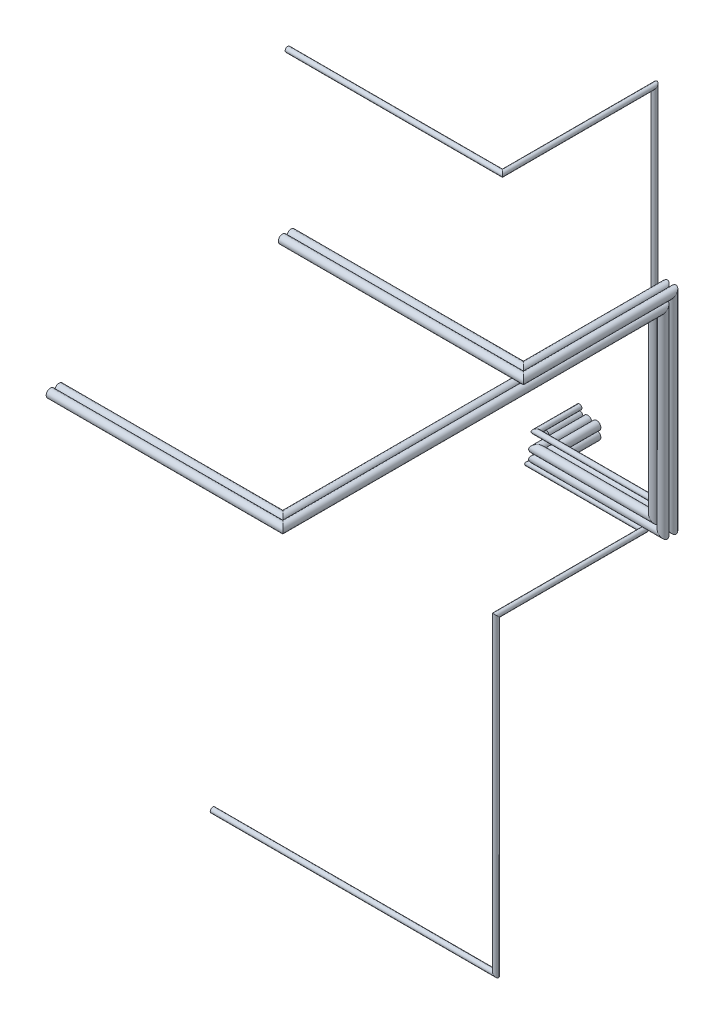
ISO-10303-21;
HEADER;
FILE_DESCRIPTION(('STEP AP214'),'2;1');
FILE_NAME('part.step','',(''),(''),'','','');
FILE_SCHEMA(('AUTOMOTIVE_DESIGN { 1 0 10303 214 1 1 1 1 }'));
ENDSEC;
DATA;
#1=APPLICATION_CONTEXT('core data for automotive mechanical design processes');
#2=APPLICATION_PROTOCOL_DEFINITION('international standard','automotive_design',2000,#1);
#3=PRODUCT_CONTEXT('',#1,'mechanical');
#4=PRODUCT('Part','Part','',(#3));
#5=PRODUCT_RELATED_PRODUCT_CATEGORY('part','',(#4));
#6=PRODUCT_DEFINITION_FORMATION('','',#4);
#7=PRODUCT_DEFINITION_CONTEXT('part definition',#1,'design');
#8=PRODUCT_DEFINITION('design','',#6,#7);
#9=PRODUCT_DEFINITION_SHAPE('','',#8);
#10=(LENGTH_UNIT() NAMED_UNIT(*) SI_UNIT(.MILLI.,.METRE.));
#11=(NAMED_UNIT(*) PLANE_ANGLE_UNIT() SI_UNIT($,.RADIAN.));
#12=(NAMED_UNIT(*) SI_UNIT($,.STERADIAN.) SOLID_ANGLE_UNIT());
#13=UNCERTAINTY_MEASURE_WITH_UNIT(LENGTH_MEASURE(1.E-05),#10,'distance_accuracy_value','');
#14=(GEOMETRIC_REPRESENTATION_CONTEXT(3) GLOBAL_UNCERTAINTY_ASSIGNED_CONTEXT((#13)) GLOBAL_UNIT_ASSIGNED_CONTEXT((#10,
#11,#12)) REPRESENTATION_CONTEXT('',''));
#15=CARTESIAN_POINT('',(0.,0.,0.));
#16=DIRECTION('',(0.,0.,1.));
#17=DIRECTION('',(1.,0.,0.));
#18=AXIS2_PLACEMENT_3D('',#15,#16,#17);
#19=CARTESIAN_POINT('',(1300.70779004029,4438.11213748302,2310.99077274705));
#20=DIRECTION('',(-1.,0.,0.));
#21=DIRECTION('',(0.,0.,1.));
#22=AXIS2_PLACEMENT_3D('',#19,#20,#21);
#23=CYLINDRICAL_SURFACE('',#22,30.);
#24=CARTESIAN_POINT('',(1300.70779004029,4438.11213748302,2310.99077274705));
#25=DIRECTION('',(-0.707106781186547,0.,0.707106781186548));
#26=DIRECTION('',(0.707106781186548,0.,0.707106781186547));
#27=AXIS2_PLACEMENT_3D('',#24,#25,#26);
#28=ELLIPSE('',#27,42.4264068711929,30.);
#29=CARTESIAN_POINT('',(1330.70779004029,4438.11213748302,2340.99077274705));
#30=VERTEX_POINT('',#29);
#31=EDGE_CURVE('E72',#30,#30,#28,.T.);
#32=ORIENTED_EDGE('',*,*,#31,.T.);
#33=EDGE_LOOP('',(#32));
#34=FACE_BOUND('',#33,.T.);
#35=CARTESIAN_POINT('',(-1240.42607973365,4438.11213748302,2310.99077274705));
#36=DIRECTION('',(-1.,0.,0.));
#37=DIRECTION('',(0.,0.,1.));
#38=AXIS2_PLACEMENT_3D('',#35,#36,#37);
#39=CIRCLE('',#38,30.);
#40=CARTESIAN_POINT('',(-1240.42607973365,4438.11213748302,2340.99077274705));
#41=VERTEX_POINT('',#40);
#42=EDGE_CURVE('E12',#41,#41,#39,.F.);
#43=ORIENTED_EDGE('',*,*,#42,.T.);
#44=EDGE_LOOP('',(#43));
#45=FACE_BOUND('',#44,.T.);
#46=ADVANCED_FACE('F66',(#34,#45),#23,.T.);
#47=CARTESIAN_POINT('',(1300.70779004029,4438.11213748302,510.99077274705));
#48=DIRECTION('',(0.,0.,1.));
#49=DIRECTION('',(1.,0.,0.));
#50=AXIS2_PLACEMENT_3D('',#47,#48,#49);
#51=CYLINDRICAL_SURFACE('',#50,30.);
#52=CARTESIAN_POINT('',(1300.70779004029,4438.11213748302,510.99077274705));
#53=DIRECTION('',(0.,0.707106781186548,0.707106781186548));
#54=DIRECTION('',(0.,0.707106781186548,-0.707106781186548));
#55=AXIS2_PLACEMENT_3D('',#52,#53,#54);
#56=ELLIPSE('',#55,42.4264068711928,30.);
#57=CARTESIAN_POINT('',(1300.70779004029,4468.11213748302,480.99077274705));
#58=VERTEX_POINT('',#57);
#59=EDGE_CURVE('E76',#58,#58,#56,.F.);
#60=ORIENTED_EDGE('',*,*,#59,.F.);
#61=EDGE_LOOP('',(#60));
#62=FACE_BOUND('',#61,.T.);
#63=ORIENTED_EDGE('',*,*,#31,.F.);
#64=EDGE_LOOP('',(#63));
#65=FACE_BOUND('',#64,.T.);
#66=ADVANCED_FACE('F110',(#62,#65),#51,.T.);
#67=CARTESIAN_POINT('',(1300.70779004029,188.112137483015,510.99077274705));
#68=DIRECTION('',(0.,1.,0.));
#69=DIRECTION('',(-1.,0.,0.));
#70=AXIS2_PLACEMENT_3D('',#67,#68,#69);
#71=CYLINDRICAL_SURFACE('',#70,30.);
#72=CARTESIAN_POINT('',(1300.70779004029,188.112137483015,510.99077274705));
#73=DIRECTION('',(0.707106781186547,0.707106781186548,0.));
#74=DIRECTION('',(0.707106781186548,-0.707106781186547,0.));
#75=AXIS2_PLACEMENT_3D('',#72,#73,#74);
#76=ELLIPSE('',#75,42.4264068711928,30.);
#77=CARTESIAN_POINT('',(1330.70779004029,158.112137483015,510.99077274705));
#78=VERTEX_POINT('',#77);
#79=EDGE_CURVE('E80',#78,#78,#76,.T.);
#80=ORIENTED_EDGE('',*,*,#79,.T.);
#81=EDGE_LOOP('',(#80));
#82=FACE_BOUND('',#81,.T.);
#83=ORIENTED_EDGE('',*,*,#59,.T.);
#84=EDGE_LOOP('',(#83));
#85=FACE_BOUND('',#84,.T.);
#86=ADVANCED_FACE('F104',(#82,#85),#71,.T.);
#87=CARTESIAN_POINT('',(-99.2922099597104,188.112137483015,510.99077274705));
#88=DIRECTION('',(1.,0.,0.));
#89=DIRECTION('',(0.,0.,-1.));
#90=AXIS2_PLACEMENT_3D('',#87,#88,#89);
#91=CYLINDRICAL_SURFACE('',#90,30.);
#92=CARTESIAN_POINT('',(-99.2922099597104,188.112137483015,510.99077274705));
#93=DIRECTION('',(0.707106781186548,0.,0.707106781186548));
#94=DIRECTION('',(0.707106781186548,0.,-0.707106781186548));
#95=AXIS2_PLACEMENT_3D('',#92,#93,#94);
#96=ELLIPSE('',#95,42.4264068711928,30.);
#97=CARTESIAN_POINT('',(-69.2922099597104,188.112137483015,480.99077274705));
#98=VERTEX_POINT('',#97);
#99=EDGE_CURVE('E85',#98,#98,#96,.F.);
#100=ORIENTED_EDGE('',*,*,#99,.F.);
#101=EDGE_LOOP('',(#100));
#102=FACE_BOUND('',#101,.T.);
#103=ORIENTED_EDGE('',*,*,#79,.F.);
#104=EDGE_LOOP('',(#103));
#105=FACE_BOUND('',#104,.T.);
#106=ADVANCED_FACE('F101',(#102,#105),#91,.T.);
#107=CARTESIAN_POINT('',(-99.2922099597104,188.112137483015,0.));
#108=DIRECTION('',(0.,0.,-1.));
#109=DIRECTION('',(-1.,0.,0.));
#110=AXIS2_PLACEMENT_3D('',#107,#108,#109);
#111=PLANE('',#110);
#112=CARTESIAN_POINT('',(-99.2922099597104,188.112137483015,0.));
#113=DIRECTION('',(0.,0.,-1.));
#114=DIRECTION('',(-1.,0.,0.));
#115=AXIS2_PLACEMENT_3D('',#112,#113,#114);
#116=CIRCLE('',#115,30.);
#117=CARTESIAN_POINT('',(-129.29220995971,188.112137483015,0.));
#118=VERTEX_POINT('',#117);
#119=EDGE_CURVE('E88',#118,#118,#116,.T.);
#120=ORIENTED_EDGE('',*,*,#119,.T.);
#121=EDGE_LOOP('',(#120));
#122=FACE_BOUND('',#121,.T.);
#123=ADVANCED_FACE('F92',(#122),#111,.T.);
#124=CARTESIAN_POINT('',(-99.2922099597104,188.112137483015,595.843586489435));
#125=DIRECTION('',(0.,0.,-1.));
#126=DIRECTION('',(-1.,0.,0.));
#127=AXIS2_PLACEMENT_3D('',#124,#125,#126);
#128=CYLINDRICAL_SURFACE('',#127,30.);
#129=ORIENTED_EDGE('',*,*,#119,.F.);
#130=EDGE_LOOP('',(#129));
#131=FACE_BOUND('',#130,.T.);
#132=ORIENTED_EDGE('',*,*,#99,.T.);
#133=EDGE_LOOP('',(#132));
#134=FACE_BOUND('',#133,.T.);
#135=ADVANCED_FACE('F94',(#131,#134),#128,.T.);
#136=CARTESIAN_POINT('',(-1240.42607973365,4438.11213748302,2310.99077274705));
#137=DIRECTION('',(-1.,0.,0.));
#138=DIRECTION('',(0.,0.,1.));
#139=AXIS2_PLACEMENT_3D('',#136,#137,#138);
#140=PLANE('',#139);
#141=ORIENTED_EDGE('',*,*,#42,.F.);
#142=EDGE_LOOP('',(#141));
#143=FACE_BOUND('',#142,.T.);
#144=ADVANCED_FACE('F97',(#143),#140,.T.);
#145=CLOSED_SHELL('',(#46,#66,#86,#106,#123,#135,#144));
#146=MANIFOLD_SOLID_BREP('B2',#145);
#147=CARTESIAN_POINT('',(1250.70779004029,-3775.40455596034,2337.65326941673));
#148=DIRECTION('',(-1.,0.,0.));
#149=DIRECTION('',(0.,0.,1.));
#150=AXIS2_PLACEMENT_3D('',#147,#148,#149);
#151=CYLINDRICAL_SURFACE('',#150,30.);
#152=CARTESIAN_POINT('',(1250.70779004029,-3775.40455596034,2337.65326941673));
#153=DIRECTION('',(-0.707106781186547,-0.707106781186548,0.));
#154=DIRECTION('',(0.707106781186548,-0.707106781186547,0.));
#155=AXIS2_PLACEMENT_3D('',#152,#153,#154);
#156=ELLIPSE('',#155,42.4264068711929,30.);
#157=CARTESIAN_POINT('',(1280.70779004029,-3805.40455596034,2337.65326941673));
#158=VERTEX_POINT('',#157);
#159=EDGE_CURVE('E181',#158,#158,#156,.T.);
#160=ORIENTED_EDGE('',*,*,#159,.T.);
#161=EDGE_LOOP('',(#160));
#162=FACE_BOUND('',#161,.T.);
#163=CARTESIAN_POINT('',(-2100.96796055242,-3775.40455596034,2337.65326941673));
#164=DIRECTION('',(-1.,0.,0.));
#165=DIRECTION('',(0.,0.,1.));
#166=AXIS2_PLACEMENT_3D('',#163,#164,#165);
#167=CIRCLE('',#166,30.);
#168=CARTESIAN_POINT('',(-2100.96796055242,-3775.40455596034,2367.65326941673));
#169=VERTEX_POINT('',#168);
#170=EDGE_CURVE('E65',#169,#169,#167,.F.);
#171=ORIENTED_EDGE('',*,*,#170,.T.);
#172=EDGE_LOOP('',(#171));
#173=FACE_BOUND('',#172,.T.);
#174=ADVANCED_FACE('F175',(#162,#173),#151,.T.);
#175=CARTESIAN_POINT('',(1250.70779004029,-103.996357315317,2337.65326941673));
#176=DIRECTION('',(0.,-1.,0.));
#177=DIRECTION('',(0.,0.,-1.));
#178=AXIS2_PLACEMENT_3D('',#175,#176,#177);
#179=CYLINDRICAL_SURFACE('',#178,30.);
#180=CARTESIAN_POINT('',(1250.70779004029,-103.996357315317,2337.65326941673));
#181=DIRECTION('',(0.,-0.707106781186548,0.707106781186547));
#182=DIRECTION('',(0.,0.707106781186547,0.707106781186548));
#183=AXIS2_PLACEMENT_3D('',#180,#181,#182);
#184=ELLIPSE('',#183,42.4264068711929,30.);
#185=CARTESIAN_POINT('',(1250.70779004029,-73.9963573153173,2367.65326941673));
#186=VERTEX_POINT('',#185);
#187=EDGE_CURVE('E185',#186,#186,#184,.F.);
#188=ORIENTED_EDGE('',*,*,#187,.F.);
#189=EDGE_LOOP('',(#188));
#190=FACE_BOUND('',#189,.T.);
#191=ORIENTED_EDGE('',*,*,#159,.F.);
#192=EDGE_LOOP('',(#191));
#193=FACE_BOUND('',#192,.T.);
#194=ADVANCED_FACE('F219',(#190,#193),#179,.T.);
#195=CARTESIAN_POINT('',(1250.70779004029,-103.996357315317,587.653269416733));
#196=DIRECTION('',(0.,0.,1.));
#197=DIRECTION('',(1.,0.,0.));
#198=AXIS2_PLACEMENT_3D('',#195,#196,#197);
#199=CYLINDRICAL_SURFACE('',#198,30.);
#200=CARTESIAN_POINT('',(1250.70779004029,-103.996357315317,587.653269416733));
#201=DIRECTION('',(0.707106781186548,0.,0.707106781186548));
#202=DIRECTION('',(0.707106781186548,0.,-0.707106781186548));
#203=AXIS2_PLACEMENT_3D('',#200,#201,#202);
#204=ELLIPSE('',#203,42.4264068711928,30.);
#205=CARTESIAN_POINT('',(1280.70779004029,-103.996357315317,557.653269416733));
#206=VERTEX_POINT('',#205);
#207=EDGE_CURVE('E189',#206,#206,#204,.T.);
#208=ORIENTED_EDGE('',*,*,#207,.T.);
#209=EDGE_LOOP('',(#208));
#210=FACE_BOUND('',#209,.T.);
#211=ORIENTED_EDGE('',*,*,#187,.T.);
#212=EDGE_LOOP('',(#211));
#213=FACE_BOUND('',#212,.T.);
#214=ADVANCED_FACE('F213',(#210,#213),#199,.T.);
#215=CARTESIAN_POINT('',(-99.2922099597104,-103.996357315317,587.653269416734));
#216=DIRECTION('',(1.,0.,0.));
#217=DIRECTION('',(0.,0.,-1.));
#218=AXIS2_PLACEMENT_3D('',#215,#216,#217);
#219=CYLINDRICAL_SURFACE('',#218,30.);
#220=CARTESIAN_POINT('',(-99.2922099597104,-103.996357315317,587.653269416734));
#221=DIRECTION('',(0.707106781186548,0.,0.707106781186547));
#222=DIRECTION('',(0.707106781186547,0.,-0.707106781186548));
#223=AXIS2_PLACEMENT_3D('',#220,#221,#222);
#224=ELLIPSE('',#223,42.4264068711928,30.);
#225=CARTESIAN_POINT('',(-69.2922099597104,-103.996357315317,557.653269416734));
#226=VERTEX_POINT('',#225);
#227=EDGE_CURVE('E194',#226,#226,#224,.F.);
#228=ORIENTED_EDGE('',*,*,#227,.F.);
#229=EDGE_LOOP('',(#228));
#230=FACE_BOUND('',#229,.T.);
#231=ORIENTED_EDGE('',*,*,#207,.F.);
#232=EDGE_LOOP('',(#231));
#233=FACE_BOUND('',#232,.T.);
#234=ADVANCED_FACE('F210',(#230,#233),#219,.T.);
#235=CARTESIAN_POINT('',(-99.2922099597104,-103.996357315317,0.));
#236=DIRECTION('',(0.,0.,-1.));
#237=DIRECTION('',(-1.,0.,0.));
#238=AXIS2_PLACEMENT_3D('',#235,#236,#237);
#239=PLANE('',#238);
#240=CARTESIAN_POINT('',(-99.2922099597104,-103.996357315317,0.));
#241=DIRECTION('',(0.,0.,-1.));
#242=DIRECTION('',(-1.,0.,0.));
#243=AXIS2_PLACEMENT_3D('',#240,#241,#242);
#244=CIRCLE('',#243,30.);
#245=CARTESIAN_POINT('',(-129.29220995971,-103.996357315317,0.));
#246=VERTEX_POINT('',#245);
#247=EDGE_CURVE('E197',#246,#246,#244,.T.);
#248=ORIENTED_EDGE('',*,*,#247,.T.);
#249=EDGE_LOOP('',(#248));
#250=FACE_BOUND('',#249,.T.);
#251=ADVANCED_FACE('F201',(#250),#239,.T.);
#252=CARTESIAN_POINT('',(-99.2922099597104,-103.996357315317,672.506083159119));
#253=DIRECTION('',(0.,0.,-1.));
#254=DIRECTION('',(-1.,0.,0.));
#255=AXIS2_PLACEMENT_3D('',#252,#253,#254);
#256=CYLINDRICAL_SURFACE('',#255,30.);
#257=ORIENTED_EDGE('',*,*,#247,.F.);
#258=EDGE_LOOP('',(#257));
#259=FACE_BOUND('',#258,.T.);
#260=ORIENTED_EDGE('',*,*,#227,.T.);
#261=EDGE_LOOP('',(#260));
#262=FACE_BOUND('',#261,.T.);
#263=ADVANCED_FACE('F203',(#259,#262),#256,.T.);
#264=CARTESIAN_POINT('',(-2100.96796055242,-3775.40455596034,2337.65326941673));
#265=DIRECTION('',(-1.,0.,0.));
#266=DIRECTION('',(0.,0.,1.));
#267=AXIS2_PLACEMENT_3D('',#264,#265,#266);
#268=PLANE('',#267);
#269=ORIENTED_EDGE('',*,*,#170,.F.);
#270=EDGE_LOOP('',(#269));
#271=FACE_BOUND('',#270,.T.);
#272=ADVANCED_FACE('F206',(#271),#268,.T.);
#273=CLOSED_SHELL('',(#174,#194,#214,#234,#251,#263,#272));
#274=MANIFOLD_SOLID_BREP('B7',#273);
#275=CARTESIAN_POINT('',(-104.92939809415,105.,400.));
#276=DIRECTION('',(0.,0.,-1.));
#277=DIRECTION('',(-1.,0.,0.));
#278=AXIS2_PLACEMENT_3D('',#275,#276,#277);
#279=CYLINDRICAL_SURFACE('',#278,50.);
#280=CARTESIAN_POINT('',(-104.92939809415,105.,400.));
#281=DIRECTION('',(0.,0.,-1.));
#282=DIRECTION('',(-1.,0.,0.));
#283=AXIS2_PLACEMENT_3D('',#280,#281,#282);
#284=CIRCLE('',#283,50.);
#285=CARTESIAN_POINT('',(-154.92939809415,105.,400.));
#286=VERTEX_POINT('',#285);
#287=EDGE_CURVE('E174',#286,#286,#284,.T.);
#288=ORIENTED_EDGE('',*,*,#287,.T.);
#289=EDGE_LOOP('',(#288));
#290=FACE_BOUND('',#289,.T.);
#291=CARTESIAN_POINT('',(-104.92939809415,105.,0.));
#292=DIRECTION('',(0.,0.,-1.));
#293=DIRECTION('',(-1.,0.,0.));
#294=AXIS2_PLACEMENT_3D('',#291,#292,#293);
#295=CIRCLE('',#294,50.);
#296=CARTESIAN_POINT('',(-154.92939809415,105.,0.));
#297=VERTEX_POINT('',#296);
#298=EDGE_CURVE('E287',#297,#297,#295,.T.);
#299=ORIENTED_EDGE('',*,*,#298,.F.);
#300=EDGE_LOOP('',(#299));
#301=FACE_BOUND('',#300,.T.);
#302=ADVANCED_FACE('F284',(#290,#301),#279,.T.);
#303=CARTESIAN_POINT('',(-104.92939809415,105.,400.));
#304=DIRECTION('',(0.,0.,-1.));
#305=DIRECTION('',(-1.,0.,0.));
#306=AXIS2_PLACEMENT_3D('',#303,#304,#305);
#307=PLANE('',#306);
#308=ORIENTED_EDGE('',*,*,#287,.F.);
#309=EDGE_LOOP('',(#308));
#310=FACE_BOUND('',#309,.T.);
#311=ADVANCED_FACE('F299',(#310),#307,.F.);
#312=CARTESIAN_POINT('',(-104.92939809415,105.,0.));
#313=DIRECTION('',(0.,0.,-1.));
#314=DIRECTION('',(-1.,0.,0.));
#315=AXIS2_PLACEMENT_3D('',#312,#313,#314);
#316=PLANE('',#315);
#317=ORIENTED_EDGE('',*,*,#298,.T.);
#318=EDGE_LOOP('',(#317));
#319=FACE_BOUND('',#318,.T.);
#320=ADVANCED_FACE('F296',(#319),#316,.T.);
#321=CLOSED_SHELL('',(#302,#311,#320));
#322=MANIFOLD_SOLID_BREP('B60',#321);
#323=CARTESIAN_POINT('',(-104.92939809415,0.,400.));
#324=DIRECTION('',(0.,0.,-1.));
#325=DIRECTION('',(-1.,0.,0.));
#326=AXIS2_PLACEMENT_3D('',#323,#324,#325);
#327=CYLINDRICAL_SURFACE('',#326,50.);
#328=CARTESIAN_POINT('',(-104.92939809415,0.,400.));
#329=DIRECTION('',(0.,0.,-1.));
#330=DIRECTION('',(-1.,0.,0.));
#331=AXIS2_PLACEMENT_3D('',#328,#329,#330);
#332=CIRCLE('',#331,50.);
#333=CARTESIAN_POINT('',(-154.92939809415,0.,400.));
#334=VERTEX_POINT('',#333);
#335=EDGE_CURVE('E283',#334,#334,#332,.T.);
#336=ORIENTED_EDGE('',*,*,#335,.T.);
#337=EDGE_LOOP('',(#336));
#338=FACE_BOUND('',#337,.T.);
#339=CARTESIAN_POINT('',(-104.92939809415,0.,0.));
#340=DIRECTION('',(0.,0.,-1.));
#341=DIRECTION('',(-1.,0.,0.));
#342=AXIS2_PLACEMENT_3D('',#339,#340,#341);
#343=CIRCLE('',#342,50.);
#344=CARTESIAN_POINT('',(-154.92939809415,0.,0.));
#345=VERTEX_POINT('',#344);
#346=EDGE_CURVE('E336',#345,#345,#343,.T.);
#347=ORIENTED_EDGE('',*,*,#346,.F.);
#348=EDGE_LOOP('',(#347));
#349=FACE_BOUND('',#348,.T.);
#350=ADVANCED_FACE('F333',(#338,#349),#327,.T.);
#351=CARTESIAN_POINT('',(-104.92939809415,0.,400.));
#352=DIRECTION('',(0.,0.,-1.));
#353=DIRECTION('',(-1.,0.,0.));
#354=AXIS2_PLACEMENT_3D('',#351,#352,#353);
#355=PLANE('',#354);
#356=ORIENTED_EDGE('',*,*,#335,.F.);
#357=EDGE_LOOP('',(#356));
#358=FACE_BOUND('',#357,.T.);
#359=ADVANCED_FACE('F348',(#358),#355,.F.);
#360=CARTESIAN_POINT('',(-104.92939809415,0.,0.));
#361=DIRECTION('',(0.,0.,-1.));
#362=DIRECTION('',(-1.,0.,0.));
#363=AXIS2_PLACEMENT_3D('',#360,#361,#362);
#364=PLANE('',#363);
#365=ORIENTED_EDGE('',*,*,#346,.T.);
#366=EDGE_LOOP('',(#365));
#367=FACE_BOUND('',#366,.T.);
#368=ADVANCED_FACE('F345',(#367),#364,.T.);
#369=CLOSED_SHELL('',(#350,#359,#368));
#370=MANIFOLD_SOLID_BREP('B169',#369);
#371=CARTESIAN_POINT('',(1388.36768599158,2300.,600.));
#372=DIRECTION('',(0.,0.,1.));
#373=DIRECTION('',(1.,0.,0.));
#374=AXIS2_PLACEMENT_3D('',#371,#372,#373);
#375=CYLINDRICAL_SURFACE('',#374,50.);
#376=CARTESIAN_POINT('',(1388.36768599158,2300.,600.));
#377=DIRECTION('',(0.,0.707106781186548,0.707106781186547));
#378=DIRECTION('',(0.,0.707106781186547,-0.707106781186548));
#379=AXIS2_PLACEMENT_3D('',#376,#377,#378);
#380=ELLIPSE('',#379,70.7106781186548,50.);
#381=CARTESIAN_POINT('',(1388.36768599158,2350.,550.));
#382=VERTEX_POINT('',#381);
#383=EDGE_CURVE('E332',#382,#382,#380,.T.);
#384=ORIENTED_EDGE('',*,*,#383,.T.);
#385=EDGE_LOOP('',(#384));
#386=FACE_BOUND('',#385,.T.);
#387=CARTESIAN_POINT('',(1388.36768599158,2300.,4998.36768599158));
#388=DIRECTION('',(-0.707106781186548,0.,0.707106781186548));
#389=DIRECTION('',(-0.707106781186548,0.,-0.707106781186548));
#390=AXIS2_PLACEMENT_3D('',#387,#388,#389);
#391=ELLIPSE('',#390,70.7106781186551,50.0000000000002);
#392=CARTESIAN_POINT('',(1338.36768599158,2300.,4948.36768599158));
#393=VERTEX_POINT('',#392);
#394=EDGE_CURVE('E404',#393,#393,#391,.T.);
#395=ORIENTED_EDGE('',*,*,#394,.F.);
#396=EDGE_LOOP('',(#395));
#397=FACE_BOUND('',#396,.T.);
#398=ADVANCED_FACE('F382',(#386,#397),#375,.T.);
#399=CARTESIAN_POINT('',(1388.36768599158,101.632314008421,600.));
#400=DIRECTION('',(0.,1.,0.));
#401=DIRECTION('',(-1.,0.,0.));
#402=AXIS2_PLACEMENT_3D('',#399,#400,#401);
#403=CYLINDRICAL_SURFACE('',#402,50.);
#404=CARTESIAN_POINT('',(1388.36768599158,101.632314008421,600.));
#405=DIRECTION('',(0.707106781186548,0.707106781186547,0.));
#406=DIRECTION('',(0.707106781186547,-0.707106781186548,0.));
#407=AXIS2_PLACEMENT_3D('',#404,#405,#406);
#408=ELLIPSE('',#407,70.7106781186548,50.);
#409=CARTESIAN_POINT('',(1438.36768599158,51.6323140084215,600.));
#410=VERTEX_POINT('',#409);
#411=EDGE_CURVE('E388',#410,#410,#408,.F.);
#412=ORIENTED_EDGE('',*,*,#411,.F.);
#413=EDGE_LOOP('',(#412));
#414=FACE_BOUND('',#413,.T.);
#415=ORIENTED_EDGE('',*,*,#383,.F.);
#416=EDGE_LOOP('',(#415));
#417=FACE_BOUND('',#416,.T.);
#418=ADVANCED_FACE('F412',(#414,#417),#403,.T.);
#419=CARTESIAN_POINT('',(-3.54847327783849E-13,101.632314008421,600.));
#420=DIRECTION('',(1.,0.,0.));
#421=DIRECTION('',(0.,1.,0.));
#422=AXIS2_PLACEMENT_3D('',#419,#420,#421);
#423=CYLINDRICAL_SURFACE('',#422,50.);
#424=CARTESIAN_POINT('',(-3.54847327783849E-13,101.632314008421,600.));
#425=DIRECTION('',(0.707106781186548,0.,0.707106781186548));
#426=DIRECTION('',(0.707106781186548,0.,-0.707106781186548));
#427=AXIS2_PLACEMENT_3D('',#424,#425,#426);
#428=ELLIPSE('',#427,70.7106781186548,50.);
#429=CARTESIAN_POINT('',(49.9999999999997,101.632314008421,550.));
#430=VERTEX_POINT('',#429);
#431=EDGE_CURVE('E392',#430,#430,#428,.T.);
#432=ORIENTED_EDGE('',*,*,#431,.T.);
#433=EDGE_LOOP('',(#432));
#434=FACE_BOUND('',#433,.T.);
#435=ORIENTED_EDGE('',*,*,#411,.T.);
#436=EDGE_LOOP('',(#435));
#437=FACE_BOUND('',#436,.T.);
#438=ADVANCED_FACE('F416',(#434,#437),#423,.T.);
#439=CARTESIAN_POINT('',(-3.54847327783849E-13,101.632314008421,741.42135623731));
#440=DIRECTION('',(0.,0.,-1.));
#441=DIRECTION('',(0.,1.,0.));
#442=AXIS2_PLACEMENT_3D('',#439,#440,#441);
#443=CYLINDRICAL_SURFACE('',#442,50.);
#444=CARTESIAN_POINT('',(-3.54847327783849E-13,101.632314008422,0.));
#445=DIRECTION('',(0.,0.,1.));
#446=DIRECTION('',(1.,0.,0.));
#447=AXIS2_PLACEMENT_3D('',#444,#445,#446);
#448=CIRCLE('',#447,50.);
#449=CARTESIAN_POINT('',(49.9999999999997,101.632314008422,0.));
#450=VERTEX_POINT('',#449);
#451=EDGE_CURVE('E396',#450,#450,#448,.T.);
#452=ORIENTED_EDGE('',*,*,#451,.T.);
#453=EDGE_LOOP('',(#452));
#454=FACE_BOUND('',#453,.T.);
#455=ORIENTED_EDGE('',*,*,#431,.F.);
#456=EDGE_LOOP('',(#455));
#457=FACE_BOUND('',#456,.T.);
#458=ADVANCED_FACE('F421',(#454,#457),#443,.T.);
#459=CARTESIAN_POINT('',(-3.54847327783849E-13,101.632314008422,0.));
#460=DIRECTION('',(0.,0.,1.));
#461=DIRECTION('',(1.,0.,0.));
#462=AXIS2_PLACEMENT_3D('',#459,#460,#461);
#463=PLANE('',#462);
#464=ORIENTED_EDGE('',*,*,#451,.F.);
#465=EDGE_LOOP('',(#464));
#466=FACE_BOUND('',#465,.T.);
#467=ADVANCED_FACE('F428',(#466),#463,.F.);
#468=CARTESIAN_POINT('',(1388.36768599158,2300.,4998.36768599158));
#469=DIRECTION('',(-1.,0.,0.));
#470=DIRECTION('',(0.,0.,1.));
#471=AXIS2_PLACEMENT_3D('',#468,#469,#470);
#472=CYLINDRICAL_SURFACE('',#471,50.0000000000002);
#473=ORIENTED_EDGE('',*,*,#394,.T.);
#474=EDGE_LOOP('',(#473));
#475=FACE_BOUND('',#474,.T.);
#476=CARTESIAN_POINT('',(-1260.,2300.,4998.36768599158));
#477=DIRECTION('',(-1.,0.,0.));
#478=DIRECTION('',(0.,0.,1.));
#479=AXIS2_PLACEMENT_3D('',#476,#477,#478);
#480=CIRCLE('',#479,50.0000000000002);
#481=CARTESIAN_POINT('',(-1260.,2300.,5048.36768599158));
#482=VERTEX_POINT('',#481);
#483=EDGE_CURVE('E401',#482,#482,#480,.F.);
#484=ORIENTED_EDGE('',*,*,#483,.T.);
#485=EDGE_LOOP('',(#484));
#486=FACE_BOUND('',#485,.T.);
#487=ADVANCED_FACE('F408',(#475,#486),#472,.T.);
#488=CARTESIAN_POINT('',(-1260.,2300.,4998.36768599158));
#489=DIRECTION('',(-1.,0.,0.));
#490=DIRECTION('',(0.,0.,1.));
#491=AXIS2_PLACEMENT_3D('',#488,#489,#490);
#492=PLANE('',#491);
#493=ORIENTED_EDGE('',*,*,#483,.F.);
#494=EDGE_LOOP('',(#493));
#495=FACE_BOUND('',#494,.T.);
#496=ADVANCED_FACE('F435',(#495),#492,.T.);
#497=CLOSED_SHELL('',(#398,#418,#438,#458,#467,#487,#496));
#498=MANIFOLD_SOLID_BREP('B278',#497);
#499=CARTESIAN_POINT('',(1388.36768599158,2404.62025979999,495.379740200007));
#500=DIRECTION('',(0.,0.,1.));
#501=DIRECTION('',(1.,0.,0.));
#502=AXIS2_PLACEMENT_3D('',#499,#500,#501);
#503=CYLINDRICAL_SURFACE('',#502,50.);
#504=CARTESIAN_POINT('',(1388.36768599158,2404.62025979999,495.379740200007));
#505=DIRECTION('',(0.,0.707106781186548,0.707106781186547));
#506=DIRECTION('',(0.,0.707106781186547,-0.707106781186548));
#507=AXIS2_PLACEMENT_3D('',#504,#505,#506);
#508=ELLIPSE('',#507,70.7106781186547,50.);
#509=CARTESIAN_POINT('',(1388.36768599158,2454.62025979999,445.379740200007));
#510=VERTEX_POINT('',#509);
#511=EDGE_CURVE('E381',#510,#510,#508,.T.);
#512=ORIENTED_EDGE('',*,*,#511,.T.);
#513=EDGE_LOOP('',(#512));
#514=FACE_BOUND('',#513,.T.);
#515=CARTESIAN_POINT('',(1388.36768599158,2404.62025979999,2150.));
#516=DIRECTION('',(-0.707106781186548,0.,0.707106781186548));
#517=DIRECTION('',(-0.707106781186548,0.,-0.707106781186548));
#518=AXIS2_PLACEMENT_3D('',#515,#516,#517);
#519=ELLIPSE('',#518,70.7106781186545,49.9999999999998);
#520=CARTESIAN_POINT('',(1338.36768599158,2404.62025979999,2100.));
#521=VERTEX_POINT('',#520);
#522=EDGE_CURVE('E518',#521,#521,#519,.T.);
#523=ORIENTED_EDGE('',*,*,#522,.F.);
#524=EDGE_LOOP('',(#523));
#525=FACE_BOUND('',#524,.T.);
#526=ADVANCED_FACE('F496',(#514,#525),#503,.T.);
#527=CARTESIAN_POINT('',(1388.36768599158,101.632314008422,495.379740200007));
#528=DIRECTION('',(0.,1.,0.));
#529=DIRECTION('',(-1.,0.,0.));
#530=AXIS2_PLACEMENT_3D('',#527,#528,#529);
#531=CYLINDRICAL_SURFACE('',#530,50.);
#532=CARTESIAN_POINT('',(1388.36768599158,101.632314008422,495.379740200007));
#533=DIRECTION('',(0.707106781186548,0.707106781186547,0.));
#534=DIRECTION('',(0.707106781186547,-0.707106781186548,0.));
#535=AXIS2_PLACEMENT_3D('',#532,#533,#534);
#536=ELLIPSE('',#535,70.7106781186547,50.);
#537=CARTESIAN_POINT('',(1438.36768599158,51.6323140084215,495.379740200007));
#538=VERTEX_POINT('',#537);
#539=EDGE_CURVE('E502',#538,#538,#536,.F.);
#540=ORIENTED_EDGE('',*,*,#539,.F.);
#541=EDGE_LOOP('',(#540));
#542=FACE_BOUND('',#541,.T.);
#543=ORIENTED_EDGE('',*,*,#511,.F.);
#544=EDGE_LOOP('',(#543));
#545=FACE_BOUND('',#544,.T.);
#546=ADVANCED_FACE('F526',(#542,#545),#531,.T.);
#547=CARTESIAN_POINT('',(104.620259799993,101.632314008422,495.379740200007));
#548=DIRECTION('',(1.,0.,0.));
#549=DIRECTION('',(0.,1.,0.));
#550=AXIS2_PLACEMENT_3D('',#547,#548,#549);
#551=CYLINDRICAL_SURFACE('',#550,50.);
#552=CARTESIAN_POINT('',(104.620259799993,101.632314008422,495.379740200007));
#553=DIRECTION('',(0.707106781186548,0.,0.707106781186548));
#554=DIRECTION('',(0.707106781186548,0.,-0.707106781186548));
#555=AXIS2_PLACEMENT_3D('',#552,#553,#554);
#556=ELLIPSE('',#555,70.7106781186547,50.);
#557=CARTESIAN_POINT('',(154.620259799993,101.632314008422,445.379740200007));
#558=VERTEX_POINT('',#557);
#559=EDGE_CURVE('E506',#558,#558,#556,.T.);
#560=ORIENTED_EDGE('',*,*,#559,.T.);
#561=EDGE_LOOP('',(#560));
#562=FACE_BOUND('',#561,.T.);
#563=ORIENTED_EDGE('',*,*,#539,.T.);
#564=EDGE_LOOP('',(#563));
#565=FACE_BOUND('',#564,.T.);
#566=ADVANCED_FACE('F530',(#562,#565),#551,.T.);
#567=CARTESIAN_POINT('',(104.620259799993,101.632314008421,636.801096437317));
#568=DIRECTION('',(0.,0.,-1.));
#569=DIRECTION('',(0.,1.,0.));
#570=AXIS2_PLACEMENT_3D('',#567,#568,#569);
#571=CYLINDRICAL_SURFACE('',#570,50.);
#572=CARTESIAN_POINT('',(104.620259799993,101.632314008422,0.));
#573=DIRECTION('',(0.,0.,1.));
#574=DIRECTION('',(1.,0.,0.));
#575=AXIS2_PLACEMENT_3D('',#572,#573,#574);
#576=CIRCLE('',#575,50.);
#577=CARTESIAN_POINT('',(154.620259799993,101.632314008422,0.));
#578=VERTEX_POINT('',#577);
#579=EDGE_CURVE('E510',#578,#578,#576,.T.);
#580=ORIENTED_EDGE('',*,*,#579,.T.);
#581=EDGE_LOOP('',(#580));
#582=FACE_BOUND('',#581,.T.);
#583=ORIENTED_EDGE('',*,*,#559,.F.);
#584=EDGE_LOOP('',(#583));
#585=FACE_BOUND('',#584,.T.);
#586=ADVANCED_FACE('F535',(#582,#585),#571,.T.);
#587=CARTESIAN_POINT('',(104.620259799993,101.632314008422,0.));
#588=DIRECTION('',(0.,0.,1.));
#589=DIRECTION('',(1.,0.,0.));
#590=AXIS2_PLACEMENT_3D('',#587,#588,#589);
#591=PLANE('',#590);
#592=ORIENTED_EDGE('',*,*,#579,.F.);
#593=EDGE_LOOP('',(#592));
#594=FACE_BOUND('',#593,.T.);
#595=ADVANCED_FACE('F542',(#594),#591,.F.);
#596=CARTESIAN_POINT('',(1388.36768599158,2404.62025979999,2150.));
#597=DIRECTION('',(-1.,0.,0.));
#598=DIRECTION('',(0.,0.,1.));
#599=AXIS2_PLACEMENT_3D('',#596,#597,#598);
#600=CYLINDRICAL_SURFACE('',#599,49.9999999999998);
#601=ORIENTED_EDGE('',*,*,#522,.T.);
#602=EDGE_LOOP('',(#601));
#603=FACE_BOUND('',#602,.T.);
#604=CARTESIAN_POINT('',(-1361.63231400842,2404.62025979999,2150.));
#605=DIRECTION('',(-1.,0.,0.));
#606=DIRECTION('',(0.,0.,1.));
#607=AXIS2_PLACEMENT_3D('',#604,#605,#606);
#608=CIRCLE('',#607,49.9999999999998);
#609=CARTESIAN_POINT('',(-1361.63231400842,2404.62025979999,2200.));
#610=VERTEX_POINT('',#609);
#611=EDGE_CURVE('E515',#610,#610,#608,.F.);
#612=ORIENTED_EDGE('',*,*,#611,.T.);
#613=EDGE_LOOP('',(#612));
#614=FACE_BOUND('',#613,.T.);
#615=ADVANCED_FACE('F522',(#603,#614),#600,.T.);
#616=CARTESIAN_POINT('',(-1361.63231400842,2404.62025979999,2150.));
#617=DIRECTION('',(-1.,0.,0.));
#618=DIRECTION('',(0.,0.,1.));
#619=AXIS2_PLACEMENT_3D('',#616,#617,#618);
#620=PLANE('',#619);
#621=ORIENTED_EDGE('',*,*,#611,.F.);
#622=EDGE_LOOP('',(#621));
#623=FACE_BOUND('',#622,.T.);
#624=ADVANCED_FACE('F549',(#623),#620,.T.);
#625=CLOSED_SHELL('',(#526,#546,#566,#586,#595,#615,#624));
#626=MANIFOLD_SOLID_BREP('B327',#625);
#627=CARTESIAN_POINT('',(1490.,2300.,600.));
#628=DIRECTION('',(0.,0.,1.));
#629=DIRECTION('',(1.,0.,0.));
#630=AXIS2_PLACEMENT_3D('',#627,#628,#629);
#631=CYLINDRICAL_SURFACE('',#630,50.);
#632=CARTESIAN_POINT('',(1490.,2300.,600.));
#633=DIRECTION('',(0.,0.707106781186548,0.707106781186547));
#634=DIRECTION('',(0.,0.707106781186547,-0.707106781186548));
#635=AXIS2_PLACEMENT_3D('',#632,#633,#634);
#636=ELLIPSE('',#635,70.7106781186548,50.);
#637=CARTESIAN_POINT('',(1490.,2350.,550.));
#638=VERTEX_POINT('',#637);
#639=EDGE_CURVE('E495',#638,#638,#636,.T.);
#640=ORIENTED_EDGE('',*,*,#639,.T.);
#641=EDGE_LOOP('',(#640));
#642=FACE_BOUND('',#641,.T.);
#643=CARTESIAN_POINT('',(1490.,2300.,5100.));
#644=DIRECTION('',(-0.707106781186548,0.,0.707106781186548));
#645=DIRECTION('',(-0.707106781186548,0.,-0.707106781186548));
#646=AXIS2_PLACEMENT_3D('',#643,#644,#645);
#647=ELLIPSE('',#646,70.7106781186548,50.);
#648=CARTESIAN_POINT('',(1440.,2300.,5050.));
#649=VERTEX_POINT('',#648);
#650=EDGE_CURVE('E631',#649,#649,#647,.T.);
#651=ORIENTED_EDGE('',*,*,#650,.F.);
#652=EDGE_LOOP('',(#651));
#653=FACE_BOUND('',#652,.T.);
#654=ADVANCED_FACE('F609',(#642,#653),#631,.T.);
#655=CARTESIAN_POINT('',(1490.,0.,600.));
#656=DIRECTION('',(0.,1.,0.));
#657=DIRECTION('',(-1.,0.,0.));
#658=AXIS2_PLACEMENT_3D('',#655,#656,#657);
#659=CYLINDRICAL_SURFACE('',#658,50.);
#660=CARTESIAN_POINT('',(1490.,0.,600.));
#661=DIRECTION('',(0.707106781186548,0.707106781186547,0.));
#662=DIRECTION('',(0.707106781186547,-0.707106781186548,0.));
#663=AXIS2_PLACEMENT_3D('',#660,#661,#662);
#664=ELLIPSE('',#663,70.7106781186548,50.);
#665=CARTESIAN_POINT('',(1540.,-50.0000000000001,600.));
#666=VERTEX_POINT('',#665);
#667=EDGE_CURVE('E615',#666,#666,#664,.F.);
#668=ORIENTED_EDGE('',*,*,#667,.F.);
#669=EDGE_LOOP('',(#668));
#670=FACE_BOUND('',#669,.T.);
#671=ORIENTED_EDGE('',*,*,#639,.F.);
#672=EDGE_LOOP('',(#671));
#673=FACE_BOUND('',#672,.T.);
#674=ADVANCED_FACE('F639',(#670,#673),#659,.T.);
#675=CARTESIAN_POINT('',(0.,0.,600.));
#676=DIRECTION('',(1.,0.,0.));
#677=DIRECTION('',(0.,1.,0.));
#678=AXIS2_PLACEMENT_3D('',#675,#676,#677);
#679=CYLINDRICAL_SURFACE('',#678,50.);
#680=CARTESIAN_POINT('',(0.,0.,600.));
#681=DIRECTION('',(0.707106781186548,0.,0.707106781186548));
#682=DIRECTION('',(0.707106781186548,0.,-0.707106781186548));
#683=AXIS2_PLACEMENT_3D('',#680,#681,#682);
#684=ELLIPSE('',#683,70.7106781186548,50.);
#685=CARTESIAN_POINT('',(50.,0.,550.));
#686=VERTEX_POINT('',#685);
#687=EDGE_CURVE('E619',#686,#686,#684,.T.);
#688=ORIENTED_EDGE('',*,*,#687,.T.);
#689=EDGE_LOOP('',(#688));
#690=FACE_BOUND('',#689,.T.);
#691=ORIENTED_EDGE('',*,*,#667,.T.);
#692=EDGE_LOOP('',(#691));
#693=FACE_BOUND('',#692,.T.);
#694=ADVANCED_FACE('F643',(#690,#693),#679,.T.);
#695=CARTESIAN_POINT('',(0.,0.,741.42135623731));
#696=DIRECTION('',(0.,0.,-1.));
#697=DIRECTION('',(0.,1.,0.));
#698=AXIS2_PLACEMENT_3D('',#695,#696,#697);
#699=CYLINDRICAL_SURFACE('',#698,50.);
#700=CARTESIAN_POINT('',(0.,0.,0.));
#701=DIRECTION('',(0.,0.,1.));
#702=DIRECTION('',(1.,0.,0.));
#703=AXIS2_PLACEMENT_3D('',#700,#701,#702);
#704=CIRCLE('',#703,50.);
#705=CARTESIAN_POINT('',(50.,0.,0.));
#706=VERTEX_POINT('',#705);
#707=EDGE_CURVE('E623',#706,#706,#704,.T.);
#708=ORIENTED_EDGE('',*,*,#707,.T.);
#709=EDGE_LOOP('',(#708));
#710=FACE_BOUND('',#709,.T.);
#711=ORIENTED_EDGE('',*,*,#687,.F.);
#712=EDGE_LOOP('',(#711));
#713=FACE_BOUND('',#712,.T.);
#714=ADVANCED_FACE('F648',(#710,#713),#699,.T.);
#715=CARTESIAN_POINT('',(0.,0.,0.));
#716=DIRECTION('',(0.,0.,1.));
#717=DIRECTION('',(1.,0.,0.));
#718=AXIS2_PLACEMENT_3D('',#715,#716,#717);
#719=PLANE('',#718);
#720=ORIENTED_EDGE('',*,*,#707,.F.);
#721=EDGE_LOOP('',(#720));
#722=FACE_BOUND('',#721,.T.);
#723=ADVANCED_FACE('F655',(#722),#719,.F.);
#724=CARTESIAN_POINT('',(1490.,2300.,5100.));
#725=DIRECTION('',(-1.,0.,0.));
#726=DIRECTION('',(0.,0.,1.));
#727=AXIS2_PLACEMENT_3D('',#724,#725,#726);
#728=CYLINDRICAL_SURFACE('',#727,50.);
#729=ORIENTED_EDGE('',*,*,#650,.T.);
#730=EDGE_LOOP('',(#729));
#731=FACE_BOUND('',#730,.T.);
#732=CARTESIAN_POINT('',(-1260.,2300.,5100.));
#733=DIRECTION('',(-1.,0.,0.));
#734=DIRECTION('',(0.,0.,1.));
#735=AXIS2_PLACEMENT_3D('',#732,#733,#734);
#736=CIRCLE('',#735,50.);
#737=CARTESIAN_POINT('',(-1260.,2300.,5150.));
#738=VERTEX_POINT('',#737);
#739=EDGE_CURVE('E628',#738,#738,#736,.F.);
#740=ORIENTED_EDGE('',*,*,#739,.T.);
#741=EDGE_LOOP('',(#740));
#742=FACE_BOUND('',#741,.T.);
#743=ADVANCED_FACE('F635',(#731,#742),#728,.T.);
#744=CARTESIAN_POINT('',(-1260.,2300.,5100.));
#745=DIRECTION('',(-1.,0.,0.));
#746=DIRECTION('',(0.,0.,1.));
#747=AXIS2_PLACEMENT_3D('',#744,#745,#746);
#748=PLANE('',#747);
#749=ORIENTED_EDGE('',*,*,#739,.F.);
#750=EDGE_LOOP('',(#749));
#751=FACE_BOUND('',#750,.T.);
#752=ADVANCED_FACE('F662',(#751),#748,.T.);
#753=CLOSED_SHELL('',(#654,#674,#694,#714,#723,#743,#752));
#754=MANIFOLD_SOLID_BREP('B376',#753);
#755=CARTESIAN_POINT('',(1490.,2404.62025979999,495.379740200007));
#756=DIRECTION('',(0.,0.,1.));
#757=DIRECTION('',(1.,0.,0.));
#758=AXIS2_PLACEMENT_3D('',#755,#756,#757);
#759=CYLINDRICAL_SURFACE('',#758,50.);
#760=CARTESIAN_POINT('',(1490.,2404.62025979999,495.379740200007));
#761=DIRECTION('',(0.,0.707106781186548,0.707106781186547));
#762=DIRECTION('',(0.,0.707106781186547,-0.707106781186548));
#763=AXIS2_PLACEMENT_3D('',#760,#761,#762);
#764=ELLIPSE('',#763,70.7106781186548,50.);
#765=CARTESIAN_POINT('',(1490.,2454.62025979999,445.379740200007));
#766=VERTEX_POINT('',#765);
#767=EDGE_CURVE('E608',#766,#766,#764,.T.);
#768=ORIENTED_EDGE('',*,*,#767,.T.);
#769=EDGE_LOOP('',(#768));
#770=FACE_BOUND('',#769,.T.);
#771=CARTESIAN_POINT('',(1490.,2404.62025979999,2251.63231400842));
#772=DIRECTION('',(-0.707106781186548,0.,0.707106781186548));
#773=DIRECTION('',(-0.707106781186548,0.,-0.707106781186548));
#774=AXIS2_PLACEMENT_3D('',#771,#772,#773);
#775=ELLIPSE('',#774,70.7106781186548,50.);
#776=CARTESIAN_POINT('',(1440.,2404.62025979999,2201.63231400842));
#777=VERTEX_POINT('',#776);
#778=EDGE_CURVE('E737',#777,#777,#775,.T.);
#779=ORIENTED_EDGE('',*,*,#778,.F.);
#780=EDGE_LOOP('',(#779));
#781=FACE_BOUND('',#780,.T.);
#782=ADVANCED_FACE('F715',(#770,#781),#759,.T.);
#783=CARTESIAN_POINT('',(1490.,0.,495.379740200007));
#784=DIRECTION('',(0.,1.,0.));
#785=DIRECTION('',(-1.,0.,0.));
#786=AXIS2_PLACEMENT_3D('',#783,#784,#785);
#787=CYLINDRICAL_SURFACE('',#786,50.);
#788=CARTESIAN_POINT('',(1490.,0.,495.379740200007));
#789=DIRECTION('',(0.707106781186548,0.707106781186547,0.));
#790=DIRECTION('',(0.707106781186547,-0.707106781186548,0.));
#791=AXIS2_PLACEMENT_3D('',#788,#789,#790);
#792=ELLIPSE('',#791,70.7106781186548,50.);
#793=CARTESIAN_POINT('',(1540.,-50.0000000000001,495.379740200007));
#794=VERTEX_POINT('',#793);
#795=EDGE_CURVE('E721',#794,#794,#792,.F.);
#796=ORIENTED_EDGE('',*,*,#795,.F.);
#797=EDGE_LOOP('',(#796));
#798=FACE_BOUND('',#797,.T.);
#799=ORIENTED_EDGE('',*,*,#767,.F.);
#800=EDGE_LOOP('',(#799));
#801=FACE_BOUND('',#800,.T.);
#802=ADVANCED_FACE('F745',(#798,#801),#787,.T.);
#803=CARTESIAN_POINT('',(104.620259799993,0.,495.379740200007));
#804=DIRECTION('',(1.,0.,0.));
#805=DIRECTION('',(0.,1.,0.));
#806=AXIS2_PLACEMENT_3D('',#803,#804,#805);
#807=CYLINDRICAL_SURFACE('',#806,50.);
#808=CARTESIAN_POINT('',(104.620259799993,0.,495.379740200007));
#809=DIRECTION('',(0.707106781186548,0.,0.707106781186548));
#810=DIRECTION('',(0.707106781186548,0.,-0.707106781186548));
#811=AXIS2_PLACEMENT_3D('',#808,#809,#810);
#812=ELLIPSE('',#811,70.7106781186548,50.);
#813=CARTESIAN_POINT('',(154.620259799993,0.,445.379740200007));
#814=VERTEX_POINT('',#813);
#815=EDGE_CURVE('E725',#814,#814,#812,.T.);
#816=ORIENTED_EDGE('',*,*,#815,.T.);
#817=EDGE_LOOP('',(#816));
#818=FACE_BOUND('',#817,.T.);
#819=ORIENTED_EDGE('',*,*,#795,.T.);
#820=EDGE_LOOP('',(#819));
#821=FACE_BOUND('',#820,.T.);
#822=ADVANCED_FACE('F749',(#818,#821),#807,.T.);
#823=CARTESIAN_POINT('',(104.620259799993,0.,636.801096437317));
#824=DIRECTION('',(0.,0.,-1.));
#825=DIRECTION('',(0.,1.,0.));
#826=AXIS2_PLACEMENT_3D('',#823,#824,#825);
#827=CYLINDRICAL_SURFACE('',#826,50.);
#828=CARTESIAN_POINT('',(104.620259799993,0.,0.));
#829=DIRECTION('',(0.,0.,1.));
#830=DIRECTION('',(1.,0.,0.));
#831=AXIS2_PLACEMENT_3D('',#828,#829,#830);
#832=CIRCLE('',#831,50.);
#833=CARTESIAN_POINT('',(154.620259799993,0.,0.));
#834=VERTEX_POINT('',#833);
#835=EDGE_CURVE('E729',#834,#834,#832,.T.);
#836=ORIENTED_EDGE('',*,*,#835,.T.);
#837=EDGE_LOOP('',(#836));
#838=FACE_BOUND('',#837,.T.);
#839=ORIENTED_EDGE('',*,*,#815,.F.);
#840=EDGE_LOOP('',(#839));
#841=FACE_BOUND('',#840,.T.);
#842=ADVANCED_FACE('F754',(#838,#841),#827,.T.);
#843=CARTESIAN_POINT('',(104.620259799993,0.,0.));
#844=DIRECTION('',(0.,0.,1.));
#845=DIRECTION('',(1.,0.,0.));
#846=AXIS2_PLACEMENT_3D('',#843,#844,#845);
#847=PLANE('',#846);
#848=ORIENTED_EDGE('',*,*,#835,.F.);
#849=EDGE_LOOP('',(#848));
#850=FACE_BOUND('',#849,.T.);
#851=ADVANCED_FACE('F761',(#850),#847,.F.);
#852=CARTESIAN_POINT('',(1490.,2404.62025979999,2251.63231400842));
#853=DIRECTION('',(-1.,0.,0.));
#854=DIRECTION('',(0.,0.,1.));
#855=AXIS2_PLACEMENT_3D('',#852,#853,#854);
#856=CYLINDRICAL_SURFACE('',#855,50.);
#857=ORIENTED_EDGE('',*,*,#778,.T.);
#858=EDGE_LOOP('',(#857));
#859=FACE_BOUND('',#858,.T.);
#860=CARTESIAN_POINT('',(-1361.63231400842,2404.62025979999,2251.63231400842));
#861=DIRECTION('',(-1.,0.,0.));
#862=DIRECTION('',(0.,0.,1.));
#863=AXIS2_PLACEMENT_3D('',#860,#861,#862);
#864=CIRCLE('',#863,50.);
#865=CARTESIAN_POINT('',(-1361.63231400842,2404.62025979999,2301.63231400842));
#866=VERTEX_POINT('',#865);
#867=EDGE_CURVE('E734',#866,#866,#864,.F.);
#868=ORIENTED_EDGE('',*,*,#867,.T.);
#869=EDGE_LOOP('',(#868));
#870=FACE_BOUND('',#869,.T.);
#871=ADVANCED_FACE('F741',(#859,#870),#856,.T.);
#872=CARTESIAN_POINT('',(-1361.63231400842,2404.62025979999,2251.63231400842));
#873=DIRECTION('',(-1.,0.,0.));
#874=DIRECTION('',(0.,0.,1.));
#875=AXIS2_PLACEMENT_3D('',#872,#873,#874);
#876=PLANE('',#875);
#877=ORIENTED_EDGE('',*,*,#867,.F.);
#878=EDGE_LOOP('',(#877));
#879=FACE_BOUND('',#878,.T.);
#880=ADVANCED_FACE('F768',(#879),#876,.T.);
#881=CLOSED_SHELL('',(#782,#802,#822,#842,#851,#871,#880));
#882=MANIFOLD_SOLID_BREP('B490',#881);
#883=ADVANCED_BREP_SHAPE_REPRESENTATION('',(#18,#146,#274,#322,#370,#498,#626,#754,#882),#14);
#884=SHAPE_DEFINITION_REPRESENTATION(#9,#883);
ENDSEC;
END-ISO-10303-21;
